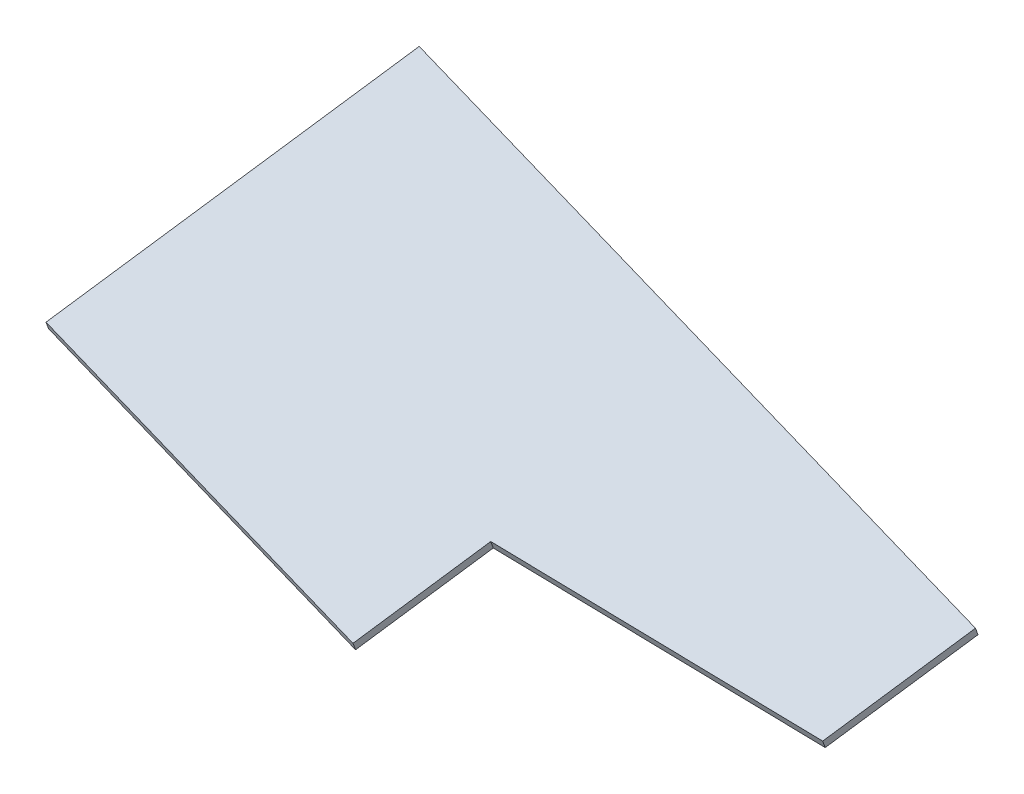
ISO-10303-21;
HEADER;
FILE_DESCRIPTION(('STEP AP214'),'2;1');
FILE_NAME('part.step','',(''),(''),'','','');
FILE_SCHEMA(('AUTOMOTIVE_DESIGN { 1 0 10303 214 1 1 1 1 }'));
ENDSEC;
DATA;
#1=APPLICATION_CONTEXT('core data for automotive mechanical design processes');
#2=APPLICATION_PROTOCOL_DEFINITION('international standard','automotive_design',2000,#1);
#3=PRODUCT_CONTEXT('',#1,'mechanical');
#4=PRODUCT('Part','Part','',(#3));
#5=PRODUCT_RELATED_PRODUCT_CATEGORY('part','',(#4));
#6=PRODUCT_DEFINITION_FORMATION('','',#4);
#7=PRODUCT_DEFINITION_CONTEXT('part definition',#1,'design');
#8=PRODUCT_DEFINITION('design','',#6,#7);
#9=PRODUCT_DEFINITION_SHAPE('','',#8);
#10=(LENGTH_UNIT() NAMED_UNIT(*) SI_UNIT(.MILLI.,.METRE.));
#11=(NAMED_UNIT(*) PLANE_ANGLE_UNIT() SI_UNIT($,.RADIAN.));
#12=(NAMED_UNIT(*) SI_UNIT($,.STERADIAN.) SOLID_ANGLE_UNIT());
#13=UNCERTAINTY_MEASURE_WITH_UNIT(LENGTH_MEASURE(1.E-05),#10,'distance_accuracy_value','');
#14=(GEOMETRIC_REPRESENTATION_CONTEXT(3) GLOBAL_UNCERTAINTY_ASSIGNED_CONTEXT((#13)) GLOBAL_UNIT_ASSIGNED_CONTEXT((#10,
#11,#12)) REPRESENTATION_CONTEXT('',''));
#15=CARTESIAN_POINT('',(0.,0.,0.));
#16=DIRECTION('',(0.,0.,1.));
#17=DIRECTION('',(1.,0.,0.));
#18=AXIS2_PLACEMENT_3D('',#15,#16,#17);
#19=CARTESIAN_POINT('',(124.593240441535,3150.90385539221,871.200518010794));
#20=DIRECTION('',(-0.97245536084359,0.169146641830463,-0.160374513947948));
#21=DIRECTION('',(-0.171364746471442,-0.985207655099562,0.));
#22=AXIS2_PLACEMENT_3D('',#19,#20,#21);
#23=PLANE('',#22);
#24=DIRECTION('',(0.213455015670893,0.369847291753579,-0.904239977587522));
#25=VECTOR('',#24,1.);
#26=CARTESIAN_POINT('',(124.312335213631,3148.16315811796,870.013222468869));
#27=LINE('',#26,#25);
#28=CARTESIAN_POINT('',(124.312335213631,3148.16315811796,870.013222468869));
#29=VERTEX_POINT('',#28);
#30=CARTESIAN_POINT('',(149.762562472296,3192.26002600624,762.200750348492));
#31=VERTEX_POINT('',#30);
#32=EDGE_CURVE('E117',#29,#31,#27,.T.);
#33=ORIENTED_EDGE('',*,*,#32,.F.);
#34=DIRECTION('',(-0.0936350759678377,-0.913565758082044,-0.395765180641852));
#35=VECTOR('',#34,1.);
#36=CARTESIAN_POINT('',(124.593240441535,3150.90385539221,871.200518010794));
#37=LINE('',#36,#35);
#38=CARTESIAN_POINT('',(124.593240441535,3150.90385539221,871.200518010794));
#39=VERTEX_POINT('',#38);
#40=EDGE_CURVE('E11',#39,#29,#37,.T.);
#41=ORIENTED_EDGE('',*,*,#40,.F.);
#42=DIRECTION('',(0.213455015670893,0.369847291753579,-0.904239977587522));
#43=VECTOR('',#42,1.);
#44=CARTESIAN_POINT('',(124.593240441535,3150.90385539221,871.200518010794));
#45=LINE('',#44,#43);
#46=CARTESIAN_POINT('',(150.0434677002,3195.00072328049,763.388045890418));
#47=VERTEX_POINT('',#46);
#48=EDGE_CURVE('E131',#39,#47,#45,.T.);
#49=ORIENTED_EDGE('',*,*,#48,.T.);
#50=DIRECTION('',(-0.0936350759678377,-0.913565758082044,-0.395765180641852));
#51=VECTOR('',#50,1.);
#52=CARTESIAN_POINT('',(150.0434677002,3195.00072328049,763.388045890418));
#53=LINE('',#52,#51);
#54=EDGE_CURVE('E36',#47,#31,#53,.T.);
#55=ORIENTED_EDGE('',*,*,#54,.T.);
#56=EDGE_LOOP('',(#33,#41,#49,#55));
#57=FACE_BOUND('',#56,.T.);
#58=ADVANCED_FACE('F33',(#57),#23,.T.);
#59=CARTESIAN_POINT('',(124.593240441535,3150.90385539221,871.200518010794));
#60=DIRECTION('',(-0.213455015670893,-0.369847291753579,0.904239977587522));
#61=DIRECTION('',(0.,-0.925571727689911,-0.37857228755036));
#62=AXIS2_PLACEMENT_3D('',#59,#60,#61);
#63=PLANE('',#62);
#64=DIRECTION('',(-0.972455360843589,0.169146641830464,-0.160374513947948));
#65=VECTOR('',#64,1.);
#66=CARTESIAN_POINT('',(124.312335213631,3148.16315811796,870.013222468869));
#67=LINE('',#66,#65);
#68=CARTESIAN_POINT('',(255.593808926462,3125.32836147103,891.663781851668));
#69=VERTEX_POINT('',#68);
#70=EDGE_CURVE('E129',#69,#29,#67,.T.);
#71=ORIENTED_EDGE('',*,*,#70,.F.);
#72=DIRECTION('',(-0.0936350759678377,-0.913565758082044,-0.395765180641852));
#73=VECTOR('',#72,1.);
#74=CARTESIAN_POINT('',(255.874714154366,3128.06905874528,892.851077393593));
#75=LINE('',#74,#73);
#76=CARTESIAN_POINT('',(255.874714154366,3128.06905874528,892.851077393593));
#77=VERTEX_POINT('',#76);
#78=EDGE_CURVE('E42',#77,#69,#75,.T.);
#79=ORIENTED_EDGE('',*,*,#78,.F.);
#80=DIRECTION('',(-0.972455360843589,0.169146641830464,-0.160374513947948));
#81=VECTOR('',#80,1.);
#82=CARTESIAN_POINT('',(124.593240441535,3150.90385539221,871.200518010794));
#83=LINE('',#82,#81);
#84=EDGE_CURVE('E107',#77,#39,#83,.T.);
#85=ORIENTED_EDGE('',*,*,#84,.T.);
#86=ORIENTED_EDGE('',*,*,#40,.T.);
#87=EDGE_LOOP('',(#71,#79,#85,#86));
#88=FACE_BOUND('',#87,.T.);
#89=ADVANCED_FACE('F139',(#88),#63,.T.);
#90=CARTESIAN_POINT('',(255.874714154366,3128.06905874528,892.851077393593));
#91=DIRECTION('',(0.97245536084359,-0.169146641830463,0.160374513947946));
#92=DIRECTION('',(0.171364746471441,0.985207655099563,0.));
#93=AXIS2_PLACEMENT_3D('',#90,#91,#92);
#94=PLANE('',#93);
#95=DIRECTION('',(-0.21345501567089,-0.369847291753573,0.904239977587525));
#96=VECTOR('',#95,1.);
#97=CARTESIAN_POINT('',(255.593808926462,3125.32836147103,891.663781851668));
#98=LINE('',#97,#96);
#99=CARTESIAN_POINT('',(264.987253047462,3141.60410864648,851.871192885107));
#100=VERTEX_POINT('',#99);
#101=EDGE_CURVE('E94',#100,#69,#98,.T.);
#102=ORIENTED_EDGE('',*,*,#101,.F.);
#103=DIRECTION('',(-0.0936350759678377,-0.913565758082044,-0.395765180641852));
#104=VECTOR('',#103,1.);
#105=CARTESIAN_POINT('',(265.268158275365,3144.34480592073,853.058488427032));
#106=LINE('',#105,#104);
#107=CARTESIAN_POINT('',(265.268158275365,3144.34480592073,853.058488427032));
#108=VERTEX_POINT('',#107);
#109=EDGE_CURVE('E89',#108,#100,#106,.T.);
#110=ORIENTED_EDGE('',*,*,#109,.F.);
#111=DIRECTION('',(-0.21345501567089,-0.369847291753573,0.904239977587525));
#112=VECTOR('',#111,1.);
#113=CARTESIAN_POINT('',(255.874714154366,3128.06905874528,892.851077393593));
#114=LINE('',#113,#112);
#115=EDGE_CURVE('E92',#108,#77,#114,.T.);
#116=ORIENTED_EDGE('',*,*,#115,.T.);
#117=ORIENTED_EDGE('',*,*,#78,.T.);
#118=EDGE_LOOP('',(#102,#110,#116,#117));
#119=FACE_BOUND('',#118,.T.);
#120=ADVANCED_FACE('F91',(#119),#94,.T.);
#121=CARTESIAN_POINT('',(265.268158275365,3144.34480592073,853.058488427032));
#122=DIRECTION('',(0.0203308024365023,-0.399183240897119,0.916645732362924));
#123=DIRECTION('',(0.,-0.916835234985618,-0.3992657659866));
#124=AXIS2_PLACEMENT_3D('',#121,#122,#123);
#125=PLANE('',#124);
#126=DIRECTION('',(-0.995398980821653,0.0777839690865184,0.0559510780268079));
#127=VECTOR('',#126,1.);
#128=CARTESIAN_POINT('',(264.987253047462,3141.60410864648,851.871192885107));
#129=LINE('',#128,#127);
#130=CARTESIAN_POINT('',(377.206624923772,3132.83489316494,845.563375665133));
#131=VERTEX_POINT('',#130);
#132=EDGE_CURVE('E126',#131,#100,#129,.T.);
#133=ORIENTED_EDGE('',*,*,#132,.F.);
#134=DIRECTION('',(-0.0936350759678377,-0.913565758082044,-0.395765180641852));
#135=VECTOR('',#134,1.);
#136=CARTESIAN_POINT('',(377.487530151676,3135.57559043918,846.750671207059));
#137=LINE('',#136,#135);
#138=CARTESIAN_POINT('',(377.487530151676,3135.57559043918,846.750671207059));
#139=VERTEX_POINT('',#138);
#140=EDGE_CURVE('E99',#139,#131,#137,.T.);
#141=ORIENTED_EDGE('',*,*,#140,.F.);
#142=DIRECTION('',(-0.995398980821653,0.0777839690865184,0.0559510780268079));
#143=VECTOR('',#142,1.);
#144=CARTESIAN_POINT('',(265.268158275365,3144.34480592073,853.058488427032));
#145=LINE('',#144,#143);
#146=EDGE_CURVE('E105',#139,#108,#145,.T.);
#147=ORIENTED_EDGE('',*,*,#146,.T.);
#148=ORIENTED_EDGE('',*,*,#109,.T.);
#149=EDGE_LOOP('',(#133,#141,#147,#148));
#150=FACE_BOUND('',#149,.T.);
#151=ADVANCED_FACE('F109',(#150),#125,.T.);
#152=CARTESIAN_POINT('',(387.906048961297,3153.62745468898,802.61565200188));
#153=DIRECTION('',(0.97245536084919,-0.16914664182076,0.160374513924223));
#154=DIRECTION('',(0.171364746460942,0.985207655101389,0.));
#155=AXIS2_PLACEMENT_3D('',#152,#153,#154);
#156=PLANE('',#155);
#157=DIRECTION('',(-0.213455015645377,-0.369847291758014,0.904239977591731));
#158=VECTOR('',#157,1.);
#159=CARTESIAN_POINT('',(387.625143733393,3150.88675741473,801.428356459955));
#160=LINE('',#159,#158);
#161=CARTESIAN_POINT('',(387.625143733393,3150.88675741473,801.428356459955));
#162=VERTEX_POINT('',#161);
#163=EDGE_CURVE('E123',#162,#131,#160,.T.);
#164=ORIENTED_EDGE('',*,*,#163,.F.);
#165=DIRECTION('',(-0.0936350759678377,-0.913565758082044,-0.395765180641852));
#166=VECTOR('',#165,1.);
#167=CARTESIAN_POINT('',(387.906048961297,3153.62745468898,802.61565200188));
#168=LINE('',#167,#166);
#169=CARTESIAN_POINT('',(387.906048961297,3153.62745468898,802.61565200188));
#170=VERTEX_POINT('',#169);
#171=EDGE_CURVE('E134',#170,#162,#168,.T.);
#172=ORIENTED_EDGE('',*,*,#171,.F.);
#173=DIRECTION('',(-0.213455015645377,-0.369847291758014,0.904239977591731));
#174=VECTOR('',#173,1.);
#175=CARTESIAN_POINT('',(387.906048961297,3153.62745468898,802.61565200188));
#176=LINE('',#175,#174);
#177=EDGE_CURVE('E110',#170,#139,#176,.T.);
#178=ORIENTED_EDGE('',*,*,#177,.T.);
#179=ORIENTED_EDGE('',*,*,#140,.T.);
#180=EDGE_LOOP('',(#164,#172,#178,#179));
#181=FACE_BOUND('',#180,.T.);
#182=ADVANCED_FACE('F152',(#181),#156,.T.);
#183=CARTESIAN_POINT('',(387.906048961297,3153.62745468898,802.61565200188));
#184=DIRECTION('',(0.213455015670893,0.369847291753579,-0.904239977587522));
#185=DIRECTION('',(0.,0.925571727689911,0.37857228755036));
#186=AXIS2_PLACEMENT_3D('',#183,#184,#185);
#187=PLANE('',#186);
#188=DIRECTION('',(0.97245536084359,-0.169146641830465,0.160374513947948));
#189=VECTOR('',#188,1.);
#190=CARTESIAN_POINT('',(387.625143733393,3150.88675741473,801.428356459955));
#191=LINE('',#190,#189);
#192=EDGE_CURVE('E120',#31,#162,#191,.T.);
#193=ORIENTED_EDGE('',*,*,#192,.F.);
#194=ORIENTED_EDGE('',*,*,#54,.F.);
#195=DIRECTION('',(0.97245536084359,-0.169146641830463,0.160374513947948));
#196=VECTOR('',#195,1.);
#197=CARTESIAN_POINT('',(150.0434677002,3195.00072328049,763.388045890418));
#198=LINE('',#197,#196);
#199=EDGE_CURVE('E112',#47,#170,#198,.T.);
#200=ORIENTED_EDGE('',*,*,#199,.T.);
#201=ORIENTED_EDGE('',*,*,#171,.T.);
#202=EDGE_LOOP('',(#193,#194,#200,#201));
#203=FACE_BOUND('',#202,.T.);
#204=ADVANCED_FACE('F154',(#203),#187,.T.);
#205=CARTESIAN_POINT('',(302.910875021289,2955.39892833719,1280.30629475176));
#206=DIRECTION('',(-0.0936350759678377,-0.913565758082044,-0.395765180641851));
#207=DIRECTION('',(0.,0.397511614039184,-0.917597142924912));
#208=AXIS2_PLACEMENT_3D('',#205,#206,#207);
#209=PLANE('',#208);
#210=ORIENTED_EDGE('',*,*,#48,.F.);
#211=ORIENTED_EDGE('',*,*,#84,.F.);
#212=ORIENTED_EDGE('',*,*,#115,.F.);
#213=ORIENTED_EDGE('',*,*,#146,.F.);
#214=ORIENTED_EDGE('',*,*,#177,.F.);
#215=ORIENTED_EDGE('',*,*,#199,.F.);
#216=EDGE_LOOP('',(#210,#211,#212,#213,#214,#215));
#217=FACE_BOUND('',#216,.T.);
#218=ADVANCED_FACE('F103',(#217),#209,.F.);
#219=CARTESIAN_POINT('',(302.629969793385,2952.65823106295,1279.11899920983));
#220=DIRECTION('',(-0.0936350759678377,-0.913565758082044,-0.395765180641851));
#221=DIRECTION('',(0.,0.397511614039184,-0.917597142924912));
#222=AXIS2_PLACEMENT_3D('',#219,#220,#221);
#223=PLANE('',#222);
#224=ORIENTED_EDGE('',*,*,#32,.T.);
#225=ORIENTED_EDGE('',*,*,#192,.T.);
#226=ORIENTED_EDGE('',*,*,#163,.T.);
#227=ORIENTED_EDGE('',*,*,#132,.T.);
#228=ORIENTED_EDGE('',*,*,#101,.T.);
#229=ORIENTED_EDGE('',*,*,#70,.T.);
#230=EDGE_LOOP('',(#224,#225,#226,#227,#228,#229));
#231=FACE_BOUND('',#230,.T.);
#232=ADVANCED_FACE('F138',(#231),#223,.T.);
#233=CLOSED_SHELL('',(#58,#89,#120,#151,#182,#204,#218,#232));
#234=MANIFOLD_SOLID_BREP('B2',#233);
#235=ADVANCED_BREP_SHAPE_REPRESENTATION('',(#18,#234),#14);
#236=SHAPE_DEFINITION_REPRESENTATION(#9,#235);
ENDSEC;
END-ISO-10303-21;
